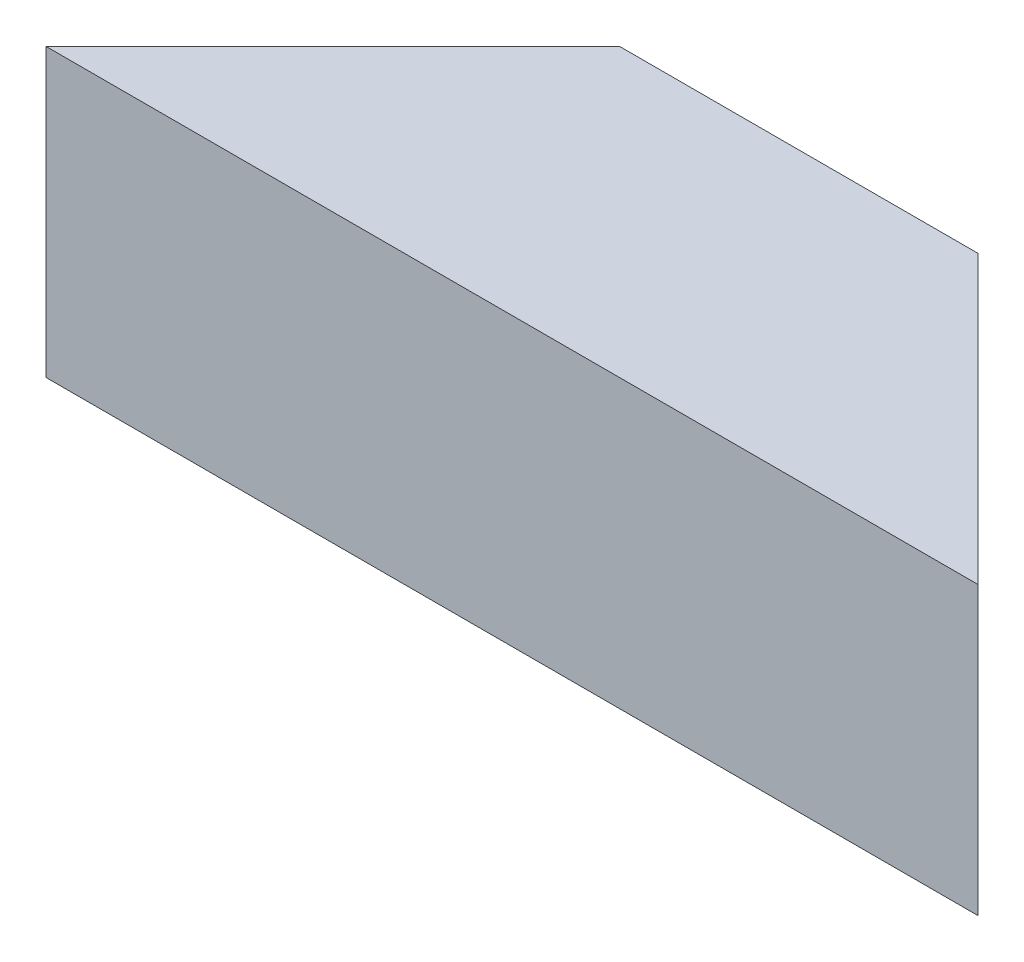
ISO-10303-21;
HEADER;
FILE_DESCRIPTION(('STEP AP214'),'2;1');
FILE_NAME('part.step','',(''),(''),'','','');
FILE_SCHEMA(('AUTOMOTIVE_DESIGN { 1 0 10303 214 1 1 1 1 }'));
ENDSEC;
DATA;
#1=APPLICATION_CONTEXT('core data for automotive mechanical design processes');
#2=APPLICATION_PROTOCOL_DEFINITION('international standard','automotive_design',2000,#1);
#3=PRODUCT_CONTEXT('',#1,'mechanical');
#4=PRODUCT('Part','Part','',(#3));
#5=PRODUCT_RELATED_PRODUCT_CATEGORY('part','',(#4));
#6=PRODUCT_DEFINITION_FORMATION('','',#4);
#7=PRODUCT_DEFINITION_CONTEXT('part definition',#1,'design');
#8=PRODUCT_DEFINITION('design','',#6,#7);
#9=PRODUCT_DEFINITION_SHAPE('','',#8);
#10=(LENGTH_UNIT() NAMED_UNIT(*) SI_UNIT(.MILLI.,.METRE.));
#11=(NAMED_UNIT(*) PLANE_ANGLE_UNIT() SI_UNIT($,.RADIAN.));
#12=(NAMED_UNIT(*) SI_UNIT($,.STERADIAN.) SOLID_ANGLE_UNIT());
#13=UNCERTAINTY_MEASURE_WITH_UNIT(LENGTH_MEASURE(1.E-05),#10,'distance_accuracy_value','');
#14=(GEOMETRIC_REPRESENTATION_CONTEXT(3) GLOBAL_UNCERTAINTY_ASSIGNED_CONTEXT((#13)) GLOBAL_UNIT_ASSIGNED_CONTEXT((#10,
#11,#12)) REPRESENTATION_CONTEXT('',''));
#15=CARTESIAN_POINT('',(0.,0.,0.));
#16=DIRECTION('',(0.,0.,1.));
#17=DIRECTION('',(1.,0.,0.));
#18=AXIS2_PLACEMENT_3D('',#15,#16,#17);
#19=CARTESIAN_POINT('',(-41.275,-3.175,-3.175));
#20=DIRECTION('',(0.,-1.,0.));
#21=DIRECTION('',(0.,0.,-1.));
#22=AXIS2_PLACEMENT_3D('',#19,#20,#21);
#23=PLANE('',#22);
#24=DIRECTION('',(-1.,0.,0.));
#25=VECTOR('',#24,1.);
#26=CARTESIAN_POINT('',(-41.275,-3.175,-25.4));
#27=LINE('',#26,#25);
#28=CARTESIAN_POINT('',(15.875,-3.175,-25.4));
#29=VERTEX_POINT('',#28);
#30=CARTESIAN_POINT('',(-15.875,-3.175,-25.4));
#31=VERTEX_POINT('',#30);
#32=EDGE_CURVE('E75',#29,#31,#27,.T.);
#33=ORIENTED_EDGE('',*,*,#32,.F.);
#34=DIRECTION('',(0.707106781186548,0.,0.707106781186548));
#35=VECTOR('',#34,1.);
#36=CARTESIAN_POINT('',(15.875,-3.175,-25.4));
#37=LINE('',#36,#35);
#38=CARTESIAN_POINT('',(38.1,-3.175,-3.175));
#39=VERTEX_POINT('',#38);
#40=EDGE_CURVE('E72',#29,#39,#37,.T.);
#41=ORIENTED_EDGE('',*,*,#40,.T.);
#42=DIRECTION('',(-1.,0.,0.));
#43=VECTOR('',#42,1.);
#44=CARTESIAN_POINT('',(-41.275,-3.175,-3.175));
#45=LINE('',#44,#43);
#46=CARTESIAN_POINT('',(-38.1,-3.175,-3.175));
#47=VERTEX_POINT('',#46);
#48=EDGE_CURVE('E19',#47,#39,#45,.F.);
#49=ORIENTED_EDGE('',*,*,#48,.F.);
#50=DIRECTION('',(0.707106781186548,0.,-0.707106781186548));
#51=VECTOR('',#50,1.);
#52=CARTESIAN_POINT('',(-41.275,-3.175,0.));
#53=LINE('',#52,#51);
#54=EDGE_CURVE('E67',#47,#31,#53,.T.);
#55=ORIENTED_EDGE('',*,*,#54,.T.);
#56=EDGE_LOOP('',(#33,#41,#49,#55));
#57=FACE_BOUND('',#56,.T.);
#58=ADVANCED_FACE('F16',(#57),#23,.T.);
#59=CARTESIAN_POINT('',(-41.275,-25.4,-3.175));
#60=DIRECTION('',(0.,0.,-1.));
#61=DIRECTION('',(-1.,0.,0.));
#62=AXIS2_PLACEMENT_3D('',#59,#60,#61);
#63=PLANE('',#62);
#64=ORIENTED_EDGE('',*,*,#48,.T.);
#65=DIRECTION('',(0.,1.,0.));
#66=VECTOR('',#65,1.);
#67=CARTESIAN_POINT('',(38.1,0.,-3.175));
#68=LINE('',#67,#66);
#69=CARTESIAN_POINT('',(38.1,-25.4,-3.175));
#70=VERTEX_POINT('',#69);
#71=EDGE_CURVE('E106',#39,#70,#68,.F.);
#72=ORIENTED_EDGE('',*,*,#71,.T.);
#73=DIRECTION('',(1.,0.,0.));
#74=VECTOR('',#73,1.);
#75=CARTESIAN_POINT('',(-41.275,-25.4,-3.175));
#76=LINE('',#75,#74);
#77=CARTESIAN_POINT('',(-38.1,-25.4,-3.175));
#78=VERTEX_POINT('',#77);
#79=EDGE_CURVE('E79',#78,#70,#76,.T.);
#80=ORIENTED_EDGE('',*,*,#79,.F.);
#81=DIRECTION('',(0.,1.,0.));
#82=VECTOR('',#81,1.);
#83=CARTESIAN_POINT('',(-38.1,0.,-3.175));
#84=LINE('',#83,#82);
#85=EDGE_CURVE('E77',#78,#47,#84,.T.);
#86=ORIENTED_EDGE('',*,*,#85,.T.);
#87=EDGE_LOOP('',(#64,#72,#80,#86));
#88=FACE_BOUND('',#87,.T.);
#89=ADVANCED_FACE('F78',(#88),#63,.T.);
#90=CARTESIAN_POINT('',(-41.275,-3.175,-25.4));
#91=DIRECTION('',(0.,0.,-1.));
#92=DIRECTION('',(-1.,0.,0.));
#93=AXIS2_PLACEMENT_3D('',#90,#91,#92);
#94=PLANE('',#93);
#95=DIRECTION('',(1.,0.,0.));
#96=VECTOR('',#95,1.);
#97=CARTESIAN_POINT('',(-41.275,0.,-25.4));
#98=LINE('',#97,#96);
#99=CARTESIAN_POINT('',(15.875,0.,-25.4));
#100=VERTEX_POINT('',#99);
#101=CARTESIAN_POINT('',(-15.875,0.,-25.4));
#102=VERTEX_POINT('',#101);
#103=EDGE_CURVE('E82',#100,#102,#98,.F.);
#104=ORIENTED_EDGE('',*,*,#103,.F.);
#105=DIRECTION('',(0.,1.,0.));
#106=VECTOR('',#105,1.);
#107=CARTESIAN_POINT('',(15.875,0.,-25.4));
#108=LINE('',#107,#106);
#109=EDGE_CURVE('E98',#100,#29,#108,.F.);
#110=ORIENTED_EDGE('',*,*,#109,.T.);
#111=ORIENTED_EDGE('',*,*,#32,.T.);
#112=DIRECTION('',(0.,1.,0.));
#113=VECTOR('',#112,1.);
#114=CARTESIAN_POINT('',(-15.875,0.,-25.4));
#115=LINE('',#114,#113);
#116=EDGE_CURVE('E87',#31,#102,#115,.T.);
#117=ORIENTED_EDGE('',*,*,#116,.T.);
#118=EDGE_LOOP('',(#104,#110,#111,#117));
#119=FACE_BOUND('',#118,.T.);
#120=ADVANCED_FACE('F96',(#119),#94,.T.);
#121=CARTESIAN_POINT('',(-41.275,0.,-25.4));
#122=DIRECTION('',(0.,1.,0.));
#123=DIRECTION('',(0.,0.,1.));
#124=AXIS2_PLACEMENT_3D('',#121,#122,#123);
#125=PLANE('',#124);
#126=DIRECTION('',(1.,0.,0.));
#127=VECTOR('',#126,1.);
#128=CARTESIAN_POINT('',(-41.275,0.,0.));
#129=LINE('',#128,#127);
#130=CARTESIAN_POINT('',(41.275,0.,0.));
#131=VERTEX_POINT('',#130);
#132=CARTESIAN_POINT('',(-41.275,0.,0.));
#133=VERTEX_POINT('',#132);
#134=EDGE_CURVE('E102',#131,#133,#129,.F.);
#135=ORIENTED_EDGE('',*,*,#134,.F.);
#136=DIRECTION('',(0.707106781186548,0.,0.707106781186548));
#137=VECTOR('',#136,1.);
#138=CARTESIAN_POINT('',(15.875,0.,-25.4));
#139=LINE('',#138,#137);
#140=EDGE_CURVE('E103',#131,#100,#139,.F.);
#141=ORIENTED_EDGE('',*,*,#140,.T.);
#142=ORIENTED_EDGE('',*,*,#103,.T.);
#143=DIRECTION('',(0.707106781186548,0.,-0.707106781186548));
#144=VECTOR('',#143,1.);
#145=CARTESIAN_POINT('',(-41.275,0.,0.));
#146=LINE('',#145,#144);
#147=EDGE_CURVE('E89',#102,#133,#146,.F.);
#148=ORIENTED_EDGE('',*,*,#147,.T.);
#149=EDGE_LOOP('',(#135,#141,#142,#148));
#150=FACE_BOUND('',#149,.T.);
#151=ADVANCED_FACE('F115',(#150),#125,.T.);
#152=CARTESIAN_POINT('',(-41.275,0.,0.));
#153=DIRECTION('',(0.707106781186548,0.,0.707106781186548));
#154=DIRECTION('',(0.707106781186548,0.,-0.707106781186548));
#155=AXIS2_PLACEMENT_3D('',#152,#153,#154);
#156=PLANE('',#155);
#157=ORIENTED_EDGE('',*,*,#147,.F.);
#158=ORIENTED_EDGE('',*,*,#116,.F.);
#159=ORIENTED_EDGE('',*,*,#54,.F.);
#160=ORIENTED_EDGE('',*,*,#85,.F.);
#161=DIRECTION('',(0.707106781186548,0.,-0.707106781186547));
#162=VECTOR('',#161,1.);
#163=CARTESIAN_POINT('',(-41.275,-25.4,0.));
#164=LINE('',#163,#162);
#165=CARTESIAN_POINT('',(-41.275,-25.4,0.));
#166=VERTEX_POINT('',#165);
#167=EDGE_CURVE('E109',#166,#78,#164,.T.);
#168=ORIENTED_EDGE('',*,*,#167,.F.);
#169=DIRECTION('',(0.,1.,0.));
#170=VECTOR('',#169,1.);
#171=CARTESIAN_POINT('',(-41.275,0.,0.));
#172=LINE('',#171,#170);
#173=EDGE_CURVE('E118',#133,#166,#172,.F.);
#174=ORIENTED_EDGE('',*,*,#173,.F.);
#175=EDGE_LOOP('',(#157,#158,#159,#160,#168,#174));
#176=FACE_BOUND('',#175,.T.);
#177=ADVANCED_FACE('F86',(#176),#156,.F.);
#178=CARTESIAN_POINT('',(-41.275,-25.4,0.));
#179=DIRECTION('',(0.,-1.,0.));
#180=DIRECTION('',(0.,0.,-1.));
#181=AXIS2_PLACEMENT_3D('',#178,#179,#180);
#182=PLANE('',#181);
#183=ORIENTED_EDGE('',*,*,#79,.T.);
#184=DIRECTION('',(0.707106781186548,0.,0.707106781186548));
#185=VECTOR('',#184,1.);
#186=CARTESIAN_POINT('',(15.875,-25.4,-25.4));
#187=LINE('',#186,#185);
#188=CARTESIAN_POINT('',(41.275,-25.4,0.));
#189=VERTEX_POINT('',#188);
#190=EDGE_CURVE('E34',#70,#189,#187,.T.);
#191=ORIENTED_EDGE('',*,*,#190,.T.);
#192=DIRECTION('',(1.,0.,0.));
#193=VECTOR('',#192,1.);
#194=CARTESIAN_POINT('',(-41.275,-25.4,0.));
#195=LINE('',#194,#193);
#196=EDGE_CURVE('E25',#166,#189,#195,.T.);
#197=ORIENTED_EDGE('',*,*,#196,.F.);
#198=ORIENTED_EDGE('',*,*,#167,.T.);
#199=EDGE_LOOP('',(#183,#191,#197,#198));
#200=FACE_BOUND('',#199,.T.);
#201=ADVANCED_FACE('F126',(#200),#182,.T.);
#202=CARTESIAN_POINT('',(15.875,0.,-25.4));
#203=DIRECTION('',(-0.707106781186548,0.,0.707106781186548));
#204=DIRECTION('',(0.707106781186548,0.,0.707106781186548));
#205=AXIS2_PLACEMENT_3D('',#202,#203,#204);
#206=PLANE('',#205);
#207=ORIENTED_EDGE('',*,*,#140,.F.);
#208=DIRECTION('',(0.,1.,0.));
#209=VECTOR('',#208,1.);
#210=CARTESIAN_POINT('',(41.275,0.,0.));
#211=LINE('',#210,#209);
#212=EDGE_CURVE('E11',#189,#131,#211,.T.);
#213=ORIENTED_EDGE('',*,*,#212,.F.);
#214=ORIENTED_EDGE('',*,*,#190,.F.);
#215=ORIENTED_EDGE('',*,*,#71,.F.);
#216=ORIENTED_EDGE('',*,*,#40,.F.);
#217=ORIENTED_EDGE('',*,*,#109,.F.);
#218=EDGE_LOOP('',(#207,#213,#214,#215,#216,#217));
#219=FACE_BOUND('',#218,.T.);
#220=ADVANCED_FACE('F105',(#219),#206,.F.);
#221=CARTESIAN_POINT('',(-41.275,0.,0.));
#222=DIRECTION('',(0.,0.,1.));
#223=DIRECTION('',(1.,0.,0.));
#224=AXIS2_PLACEMENT_3D('',#221,#222,#223);
#225=PLANE('',#224);
#226=ORIENTED_EDGE('',*,*,#196,.T.);
#227=ORIENTED_EDGE('',*,*,#212,.T.);
#228=ORIENTED_EDGE('',*,*,#134,.T.);
#229=ORIENTED_EDGE('',*,*,#173,.T.);
#230=EDGE_LOOP('',(#226,#227,#228,#229));
#231=FACE_BOUND('',#230,.T.);
#232=ADVANCED_FACE('F122',(#231),#225,.T.);
#233=CLOSED_SHELL('',(#58,#89,#120,#151,#177,#201,#220,#232));
#234=MANIFOLD_SOLID_BREP('B1',#233);
#235=ADVANCED_BREP_SHAPE_REPRESENTATION('',(#18,#234),#14);
#236=SHAPE_DEFINITION_REPRESENTATION(#9,#235);
ENDSEC;
END-ISO-10303-21;
